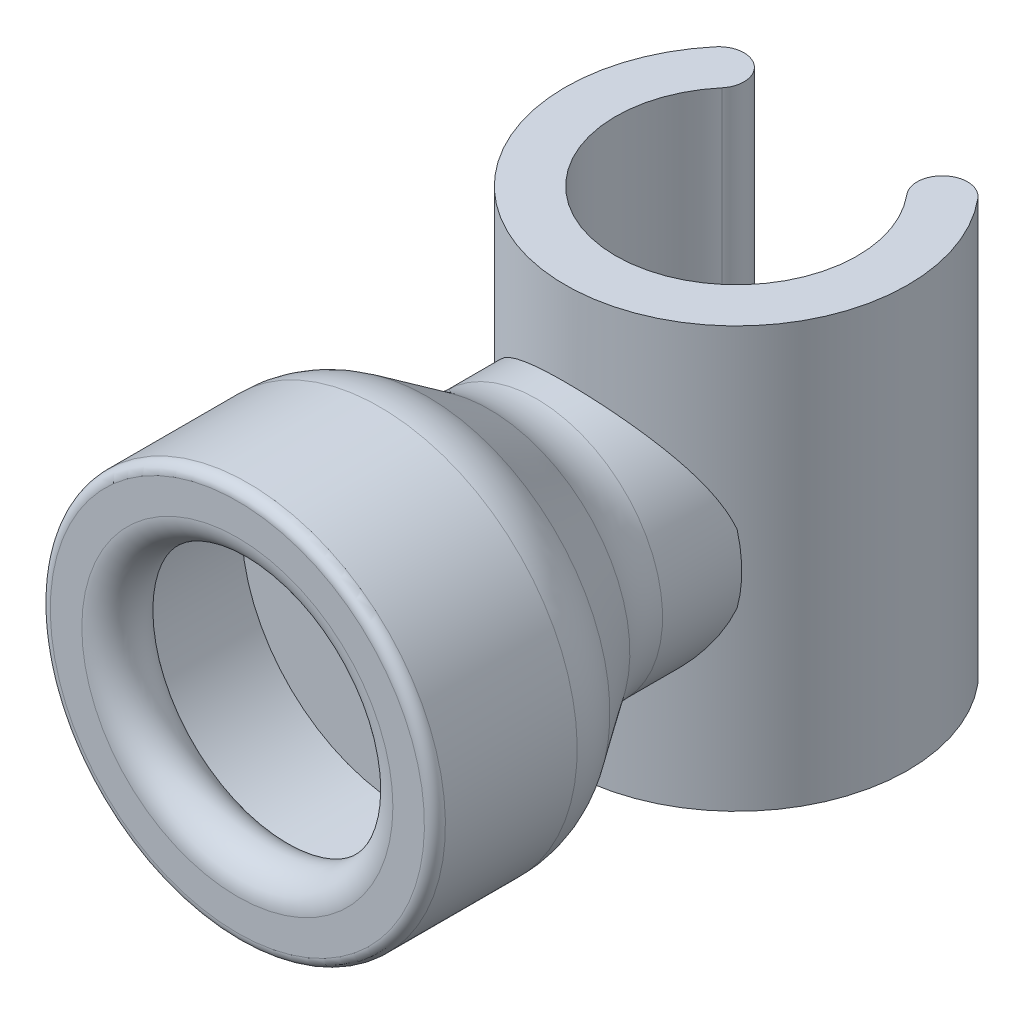
ISO-10303-21;
HEADER;
FILE_DESCRIPTION(('STEP AP214'),'2;1');
FILE_NAME('part.step','',(''),(''),'','','');
FILE_SCHEMA(('AUTOMOTIVE_DESIGN { 1 0 10303 214 1 1 1 1 }'));
ENDSEC;
DATA;
#1=APPLICATION_CONTEXT('core data for automotive mechanical design processes');
#2=APPLICATION_PROTOCOL_DEFINITION('international standard','automotive_design',2000,#1);
#3=PRODUCT_CONTEXT('',#1,'mechanical');
#4=PRODUCT('Part','Part','',(#3));
#5=PRODUCT_RELATED_PRODUCT_CATEGORY('part','',(#4));
#6=PRODUCT_DEFINITION_FORMATION('','',#4);
#7=PRODUCT_DEFINITION_CONTEXT('part definition',#1,'design');
#8=PRODUCT_DEFINITION('design','',#6,#7);
#9=PRODUCT_DEFINITION_SHAPE('','',#8);
#10=(LENGTH_UNIT() NAMED_UNIT(*) SI_UNIT(.MILLI.,.METRE.));
#11=(NAMED_UNIT(*) PLANE_ANGLE_UNIT() SI_UNIT($,.RADIAN.));
#12=(NAMED_UNIT(*) SI_UNIT($,.STERADIAN.) SOLID_ANGLE_UNIT());
#13=UNCERTAINTY_MEASURE_WITH_UNIT(LENGTH_MEASURE(1.E-05),#10,'distance_accuracy_value','');
#14=(GEOMETRIC_REPRESENTATION_CONTEXT(3) GLOBAL_UNCERTAINTY_ASSIGNED_CONTEXT((#13)) GLOBAL_UNIT_ASSIGNED_CONTEXT((#10,
#11,#12)) REPRESENTATION_CONTEXT('',''));
#15=CARTESIAN_POINT('',(0.,0.,0.));
#16=DIRECTION('',(0.,0.,1.));
#17=DIRECTION('',(1.,0.,0.));
#18=AXIS2_PLACEMENT_3D('',#15,#16,#17);
#19=CARTESIAN_POINT('',(0.,-5.,0.));
#20=DIRECTION('',(0.,-1.,0.));
#21=DIRECTION('',(1.,0.,0.));
#22=AXIS2_PLACEMENT_3D('',#19,#20,#21);
#23=PLANE('',#22);
#24=CARTESIAN_POINT('',(0.,-5.,0.));
#25=DIRECTION('',(0.,-1.,0.));
#26=DIRECTION('',(1.,0.,0.));
#27=AXIS2_PLACEMENT_3D('',#24,#25,#26);
#28=CIRCLE('',#27,4.075);
#29=CARTESIAN_POINT('',(3.11900642441656,-5.,-2.62248430394696));
#30=VERTEX_POINT('',#29);
#31=CARTESIAN_POINT('',(-3.11900642441657,-5.,-2.62248430394696));
#32=VERTEX_POINT('',#31);
#33=EDGE_CURVE('E223',#30,#32,#28,.T.);
#34=ORIENTED_EDGE('',*,*,#33,.T.);
#35=CARTESIAN_POINT('',(-2.65976621468652,-5.,-2.2363516456971));
#36=DIRECTION('',(0.,-1.,0.));
#37=DIRECTION('',(1.,0.,0.));
#38=AXIS2_PLACEMENT_3D('',#35,#36,#37);
#39=CIRCLE('',#38,0.6);
#40=CARTESIAN_POINT('',(-2.20013954881513,-5.,-2.62202421150903));
#41=VERTEX_POINT('',#40);
#42=EDGE_CURVE('E217',#32,#41,#39,.T.);
#43=ORIENTED_EDGE('',*,*,#42,.T.);
#44=CARTESIAN_POINT('',(-2.65976621468652,-5.,-2.2363516456971));
#45=DIRECTION('',(0.,-1.,0.));
#46=DIRECTION('',(1.,0.,0.));
#47=AXIS2_PLACEMENT_3D('',#44,#45,#46);
#48=CIRCLE('',#47,0.6);
#49=CARTESIAN_POINT('',(-2.20052600495647,-5.,-1.85021898744724));
#50=VERTEX_POINT('',#49);
#51=EDGE_CURVE('E63',#41,#50,#48,.T.);
#52=ORIENTED_EDGE('',*,*,#51,.T.);
#53=CARTESIAN_POINT('',(0.,-5.,0.));
#54=DIRECTION('',(0.,-1.,0.));
#55=DIRECTION('',(1.,0.,0.));
#56=AXIS2_PLACEMENT_3D('',#53,#54,#55);
#57=CIRCLE('',#56,2.875);
#58=CARTESIAN_POINT('',(2.20052600495647,-5.,-1.85021898744724));
#59=VERTEX_POINT('',#58);
#60=EDGE_CURVE('E140',#59,#50,#57,.T.);
#61=ORIENTED_EDGE('',*,*,#60,.F.);
#62=CARTESIAN_POINT('',(2.65976621468652,-5.,-2.2363516456971));
#63=DIRECTION('',(0.,-1.,0.));
#64=DIRECTION('',(1.,0.,0.));
#65=AXIS2_PLACEMENT_3D('',#62,#63,#64);
#66=CIRCLE('',#65,0.6);
#67=CARTESIAN_POINT('',(2.20013954881513,-5.,-2.62202421150903));
#68=VERTEX_POINT('',#67);
#69=EDGE_CURVE('E209',#59,#68,#66,.T.);
#70=ORIENTED_EDGE('',*,*,#69,.T.);
#71=CARTESIAN_POINT('',(2.65976621468652,-5.,-2.2363516456971));
#72=DIRECTION('',(0.,-1.,0.));
#73=DIRECTION('',(1.,0.,0.));
#74=AXIS2_PLACEMENT_3D('',#71,#72,#73);
#75=CIRCLE('',#74,0.6);
#76=EDGE_CURVE('E212',#68,#30,#75,.T.);
#77=ORIENTED_EDGE('',*,*,#76,.T.);
#78=EDGE_LOOP('',(#34,#43,#52,#61,#70,#77));
#79=FACE_BOUND('',#78,.T.);
#80=ADVANCED_FACE('F45',(#79),#23,.T.);
#81=CARTESIAN_POINT('',(0.,5.,0.));
#82=DIRECTION('',(0.,-1.,0.));
#83=DIRECTION('',(1.,0.,0.));
#84=AXIS2_PLACEMENT_3D('',#81,#82,#83);
#85=PLANE('',#84);
#86=CARTESIAN_POINT('',(-2.65976621468652,5.,-2.2363516456971));
#87=DIRECTION('',(0.,-1.,0.));
#88=DIRECTION('',(1.,0.,0.));
#89=AXIS2_PLACEMENT_3D('',#86,#87,#88);
#90=CIRCLE('',#89,0.6);
#91=CARTESIAN_POINT('',(-2.20052600495647,5.,-1.85021898744725));
#92=VERTEX_POINT('',#91);
#93=CARTESIAN_POINT('',(-2.20013954881513,5.,-2.62202421150903));
#94=VERTEX_POINT('',#93);
#95=EDGE_CURVE('E178',#92,#94,#90,.F.);
#96=ORIENTED_EDGE('',*,*,#95,.T.);
#97=CARTESIAN_POINT('',(-2.65976621468652,5.,-2.2363516456971));
#98=DIRECTION('',(0.,-1.,0.));
#99=DIRECTION('',(1.,0.,0.));
#100=AXIS2_PLACEMENT_3D('',#97,#98,#99);
#101=CIRCLE('',#100,0.6);
#102=CARTESIAN_POINT('',(-3.11900642441657,5.,-2.62248430394696));
#103=VERTEX_POINT('',#102);
#104=EDGE_CURVE('E182',#94,#103,#101,.F.);
#105=ORIENTED_EDGE('',*,*,#104,.T.);
#106=CARTESIAN_POINT('',(0.,5.,0.));
#107=DIRECTION('',(0.,-1.,0.));
#108=DIRECTION('',(1.,0.,0.));
#109=AXIS2_PLACEMENT_3D('',#106,#107,#108);
#110=CIRCLE('',#109,4.075);
#111=CARTESIAN_POINT('',(3.11900642441656,5.,-2.62248430394697));
#112=VERTEX_POINT('',#111);
#113=EDGE_CURVE('E225',#112,#103,#110,.T.);
#114=ORIENTED_EDGE('',*,*,#113,.F.);
#115=CARTESIAN_POINT('',(2.65976621468652,5.,-2.23635164569711));
#116=DIRECTION('',(0.,-1.,0.));
#117=DIRECTION('',(1.,0.,0.));
#118=AXIS2_PLACEMENT_3D('',#115,#116,#117);
#119=CIRCLE('',#118,0.6);
#120=CARTESIAN_POINT('',(2.20013954881513,5.,-2.62202421150903));
#121=VERTEX_POINT('',#120);
#122=EDGE_CURVE('E187',#112,#121,#119,.F.);
#123=ORIENTED_EDGE('',*,*,#122,.T.);
#124=CARTESIAN_POINT('',(2.65976621468652,5.,-2.23635164569711));
#125=DIRECTION('',(0.,-1.,0.));
#126=DIRECTION('',(1.,0.,0.));
#127=AXIS2_PLACEMENT_3D('',#124,#125,#126);
#128=CIRCLE('',#127,0.6);
#129=CARTESIAN_POINT('',(2.20052600495647,5.,-1.85021898744725));
#130=VERTEX_POINT('',#129);
#131=EDGE_CURVE('E257',#121,#130,#128,.F.);
#132=ORIENTED_EDGE('',*,*,#131,.T.);
#133=CARTESIAN_POINT('',(0.,5.,0.));
#134=DIRECTION('',(0.,-1.,0.));
#135=DIRECTION('',(1.,0.,0.));
#136=AXIS2_PLACEMENT_3D('',#133,#134,#135);
#137=CIRCLE('',#136,2.875);
#138=EDGE_CURVE('E135',#130,#92,#137,.T.);
#139=ORIENTED_EDGE('',*,*,#138,.T.);
#140=EDGE_LOOP('',(#96,#105,#114,#123,#132,#139));
#141=FACE_BOUND('',#140,.T.);
#142=ADVANCED_FACE('F170',(#141),#85,.F.);
#143=CARTESIAN_POINT('',(0.,-5.,0.));
#144=DIRECTION('',(0.,1.,0.));
#145=DIRECTION('',(-1.,0.,0.));
#146=AXIS2_PLACEMENT_3D('',#143,#144,#145);
#147=CYLINDRICAL_SURFACE('',#146,4.075);
#148=CARTESIAN_POINT('',(2.88790581563873,-0.812403840463599,2.875));
#149=CARTESIAN_POINT('',(2.86396987335777,-0.897453284394713,2.89904984617288));
#150=CARTESIAN_POINT('',(2.8365410358721,-0.980582858815973,2.9259981833262));
#151=CARTESIAN_POINT('',(2.77521081091253,-1.1426790618383,2.9842252696767));
#152=CARTESIAN_POINT('',(2.74132052686743,-1.2216525395088,3.01549656526744));
#153=CARTESIAN_POINT('',(2.66755311843785,-1.37528525505905,3.08094386239194));
#154=CARTESIAN_POINT('',(2.62768534592957,-1.44995098416575,3.1151152910095));
#155=CARTESIAN_POINT('',(2.54221793107529,-1.59506134909615,3.18524978771818));
#156=CARTESIAN_POINT('',(2.49661555196243,-1.66550394562205,3.22121370627193));
#157=CARTESIAN_POINT('',(2.35215234253959,-1.8695058096925,3.32977646102683));
#158=CARTESIAN_POINT('',(2.24512126426353,-1.99679729167083,3.40352574297608));
#159=CARTESIAN_POINT('',(2.01026162839675,-2.23306280346649,3.5473171158555));
#160=CARTESIAN_POINT('',(1.88242829260121,-2.34203261314063,3.61735835014989));
#161=CARTESIAN_POINT('',(1.62244812061208,-2.52789559651073,3.74053719482807));
#162=CARTESIAN_POINT('',(1.49238205711021,-2.60701306321136,3.79468919471361));
#163=CARTESIAN_POINT('',(1.21816452406372,-2.74583079814262,3.89136554152056));
#164=CARTESIAN_POINT('',(1.07402526042738,-2.80554770161209,3.93389984515969));
#165=CARTESIAN_POINT('',(0.849133978576695,-2.87841739896584,3.98630590120425));
#166=CARTESIAN_POINT('',(0.772342912189284,-2.89998413772647,4.00192127508929));
#167=CARTESIAN_POINT('',(0.616587043103844,-2.93704195364046,4.02885537442209));
#168=CARTESIAN_POINT('',(0.537623375764297,-2.95253614199359,4.04017629998419));
#169=CARTESIAN_POINT('',(0.378214827153008,-2.9771552833664,4.05820257518367));
#170=CARTESIAN_POINT('',(0.297770523200099,-2.98628266705923,4.06490968623662));
#171=CARTESIAN_POINT('',(0.136180671361998,-2.99800395355235,4.07352912946396));
#172=CARTESIAN_POINT('',(0.0550352227760893,-3.00059876678596,4.07544212978531));
#173=CARTESIAN_POINT('',(-0.166424725485071,-2.99865452277607,4.07400718415628));
#174=CARTESIAN_POINT('',(-0.306732934675275,-2.98753283705214,4.06580511493588));
#175=CARTESIAN_POINT('',(-0.582841730451785,-2.94615546987724,4.03550076286465));
#176=CARTESIAN_POINT('',(-0.718641941200782,-2.91589819726477,4.01339732408859));
#177=CARTESIAN_POINT('',(-0.981296699021089,-2.83824899253106,3.95734353287424));
#178=CARTESIAN_POINT('',(-1.10821751309609,-2.7910049986219,3.92349555063636));
#179=CARTESIAN_POINT('',(-1.35211950668457,-2.68135662622725,3.84626903740088));
#180=CARTESIAN_POINT('',(-1.46910013379195,-2.61895140592957,3.80288997721233));
#181=CARTESIAN_POINT('',(-1.70756308655748,-2.47115220306957,3.70254811320194));
#182=CARTESIAN_POINT('',(-1.8273544699331,-2.38375748511809,3.64453242110091));
#183=CARTESIAN_POINT('',(-2.05157956416729,-2.19378235083265,3.52319879903805));
#184=CARTESIAN_POINT('',(-2.15598082321218,-2.09117073608246,3.45987009474344));
#185=CARTESIAN_POINT('',(-2.30973124710229,-1.91643096155526,3.3579059581445));
#186=CARTESIAN_POINT('',(-2.36432373066228,-1.84865961741318,3.31959248315098));
#187=CARTESIAN_POINT('',(-2.46757347071481,-1.70841353961342,3.24358277328851));
#188=CARTESIAN_POINT('',(-2.51622850859452,-1.63593706321784,3.20588677367565));
#189=CARTESIAN_POINT('',(-2.65265498041123,-1.41204032010555,3.09557520389261));
#190=CARTESIAN_POINT('',(-2.73143027027953,-1.25353890980507,3.02535910804588));
#191=CARTESIAN_POINT('',(-2.81358767936852,-1.04211498087328,2.94786908207971));
#192=CARTESIAN_POINT('',(-2.82989564809637,-0.997002922802062,2.93219709791875));
#193=CARTESIAN_POINT('',(-2.86045906191798,-0.905590905107362,2.90238628679099));
#194=CARTESIAN_POINT('',(-2.8747143759611,-0.85929086986026,2.88824755772824));
#195=CARTESIAN_POINT('',(-2.88790581563873,-0.812403840463599,2.875));
#196=B_SPLINE_CURVE_WITH_KNOTS('',3,(#148,#149,#150,#151,#152,#153,#154,#155,#156,#157,#158,
#159,#160,#161,#162,#163,#164,#165,#166,#167,#168,#169,#170,#171,#172,#173,#174,#175,#176,#177,
#178,#179,#180,#181,#182,#183,#184,#185,#186,#187,#188,#189,#190,#191,#192,#193,#194,#195),
.UNSPECIFIED.,.F.,.F.,(4,2,2,2,2,2,2,2,2,2,2,2,2,2,2,2,2,2,2,2,2,2,2,4),(0.,0.27441510762216,
0.548362839222509,0.821886363208285,1.09554092170355,1.63907956269224,2.18274322926595,
2.66561366767767,3.14806896364641,3.3915877967518,3.63498170223898,3.87828263560953,
4.12154965866139,4.54222622834102,4.96293778270041,5.38007072589025,5.7972268352725,
6.2732018086239,6.75016649740683,7.03512834484124,7.32019634846556,7.8876538296769,
8.03899172374996,8.19033927562882),.UNSPECIFIED.);
#197=CARTESIAN_POINT('',(2.88790581563873,-0.812403840463599,2.875));
#198=VERTEX_POINT('',#197);
#199=CARTESIAN_POINT('',(-2.88790581563873,-0.812403840463599,2.875));
#200=VERTEX_POINT('',#199);
#201=EDGE_CURVE('E127',#198,#200,#196,.T.);
#202=ORIENTED_EDGE('',*,*,#201,.T.);
#203=DIRECTION('',(0.,1.,0.));
#204=VECTOR('',#203,1.);
#205=CARTESIAN_POINT('',(-2.88790581563873,-5.,2.875));
#206=LINE('',#205,#204);
#207=CARTESIAN_POINT('',(-2.88790581563873,0.8124038404636,2.875));
#208=VERTEX_POINT('',#207);
#209=EDGE_CURVE('E120',#200,#208,#206,.T.);
#210=ORIENTED_EDGE('',*,*,#209,.T.);
#211=CARTESIAN_POINT('',(-2.88790581563873,0.8124038404636,2.875));
#212=CARTESIAN_POINT('',(-2.86396987335777,0.897453284394714,2.89904984617288));
#213=CARTESIAN_POINT('',(-2.8365410358721,0.980582858815974,2.9259981833262));
#214=CARTESIAN_POINT('',(-2.77521081091253,1.14267906183831,2.9842252696767));
#215=CARTESIAN_POINT('',(-2.74132052686743,1.2216525395088,3.01549656526744));
#216=CARTESIAN_POINT('',(-2.66755311843785,1.37528525505905,3.08094386239194));
#217=CARTESIAN_POINT('',(-2.62768534592957,1.44995098416575,3.1151152910095));
#218=CARTESIAN_POINT('',(-2.54221793107529,1.59506134909615,3.18524978771818));
#219=CARTESIAN_POINT('',(-2.49661555196243,1.66550394562205,3.22121370627193));
#220=CARTESIAN_POINT('',(-2.35215234253959,1.8695058096925,3.32977646102683));
#221=CARTESIAN_POINT('',(-2.24512126426353,1.99679729167083,3.40352574297608));
#222=CARTESIAN_POINT('',(-2.01026162839675,2.23306280346649,3.5473171158555));
#223=CARTESIAN_POINT('',(-1.88242829260121,2.34203261314063,3.61735835014989));
#224=CARTESIAN_POINT('',(-1.62244812061208,2.52789559651073,3.74053719482807));
#225=CARTESIAN_POINT('',(-1.49238205711021,2.60701306321136,3.79468919471361));
#226=CARTESIAN_POINT('',(-1.21816452406372,2.74583079814262,3.89136554152056));
#227=CARTESIAN_POINT('',(-1.07402526042738,2.80554770161209,3.93389984515969));
#228=CARTESIAN_POINT('',(-0.849133978576695,2.87841739896584,3.98630590120425));
#229=CARTESIAN_POINT('',(-0.772342912189283,2.89998413772647,4.00192127508929));
#230=CARTESIAN_POINT('',(-0.616587043103844,2.93704195364046,4.02885537442209));
#231=CARTESIAN_POINT('',(-0.537623375764296,2.95253614199359,4.04017629998419));
#232=CARTESIAN_POINT('',(-0.378214827153008,2.9771552833664,4.05820257518367));
#233=CARTESIAN_POINT('',(-0.297770523200098,2.98628266705923,4.06490968623662));
#234=CARTESIAN_POINT('',(-0.136180671361998,2.99800395355235,4.07352912946396));
#235=CARTESIAN_POINT('',(-0.0550352227760893,3.00059876678596,4.07544212978531));
#236=CARTESIAN_POINT('',(0.166424725485071,2.99865452277607,4.07400718415628));
#237=CARTESIAN_POINT('',(0.306732934675275,2.98753283705214,4.06580511493588));
#238=CARTESIAN_POINT('',(0.582841730451785,2.94615546987724,4.03550076286465));
#239=CARTESIAN_POINT('',(0.718641941200782,2.91589819726477,4.01339732408859));
#240=CARTESIAN_POINT('',(0.981296699021089,2.83824899253106,3.95734353287424));
#241=CARTESIAN_POINT('',(1.10821751309609,2.7910049986219,3.92349555063636));
#242=CARTESIAN_POINT('',(1.35211950668457,2.68135662622725,3.84626903740088));
#243=CARTESIAN_POINT('',(1.46910013379195,2.61895140592957,3.80288997721233));
#244=CARTESIAN_POINT('',(1.70756308655748,2.47115220306957,3.70254811320194));
#245=CARTESIAN_POINT('',(1.8273544699331,2.38375748511809,3.64453242110091));
#246=CARTESIAN_POINT('',(2.05157956416729,2.19378235083266,3.52319879903805));
#247=CARTESIAN_POINT('',(2.15598082321219,2.09117073608246,3.45987009474344));
#248=CARTESIAN_POINT('',(2.30973124710229,1.91643096155526,3.3579059581445));
#249=CARTESIAN_POINT('',(2.36432373066228,1.84865961741318,3.31959248315098));
#250=CARTESIAN_POINT('',(2.46757347071481,1.70841353961342,3.24358277328851));
#251=CARTESIAN_POINT('',(2.51622850859452,1.63593706321784,3.20588677367565));
#252=CARTESIAN_POINT('',(2.65265498041123,1.41204032010555,3.09557520389261));
#253=CARTESIAN_POINT('',(2.73143027027953,1.25353890980507,3.02535910804588));
#254=CARTESIAN_POINT('',(2.81358767936852,1.04211498087328,2.94786908207971));
#255=CARTESIAN_POINT('',(2.82989564809637,0.997002922802063,2.93219709791875));
#256=CARTESIAN_POINT('',(2.86045906191798,0.905590905107363,2.90238628679099));
#257=CARTESIAN_POINT('',(2.8747143759611,0.85929086986026,2.88824755772824));
#258=CARTESIAN_POINT('',(2.88790581563873,0.812403840463599,2.875));
#259=B_SPLINE_CURVE_WITH_KNOTS('',3,(#211,#212,#213,#214,#215,#216,#217,#218,#219,#220,#221,
#222,#223,#224,#225,#226,#227,#228,#229,#230,#231,#232,#233,#234,#235,#236,#237,#238,#239,#240,
#241,#242,#243,#244,#245,#246,#247,#248,#249,#250,#251,#252,#253,#254,#255,#256,#257,#258),
.UNSPECIFIED.,.F.,.F.,(4,2,2,2,2,2,2,2,2,2,2,2,2,2,2,2,2,2,2,2,2,2,2,4),(0.,0.27441510762216,
0.54836283922251,0.821886363208286,1.09554092170355,1.63907956269224,2.18274322926595,
2.66561366767767,3.14806896364641,3.3915877967518,3.63498170223898,3.87828263560953,
4.12154965866139,4.54222622834102,4.96293778270041,5.38007072589025,5.7972268352725,
6.2732018086239,6.75016649740683,7.03512834484124,7.32019634846556,7.8876538296769,
8.03899172374996,8.19033927562882),.UNSPECIFIED.);
#260=CARTESIAN_POINT('',(2.88790581563873,0.8124038404636,2.875));
#261=VERTEX_POINT('',#260);
#262=EDGE_CURVE('E125',#208,#261,#259,.T.);
#263=ORIENTED_EDGE('',*,*,#262,.T.);
#264=DIRECTION('',(0.,1.,0.));
#265=VECTOR('',#264,1.);
#266=CARTESIAN_POINT('',(2.88790581563873,-5.,2.875));
#267=LINE('',#266,#265);
#268=EDGE_CURVE('E111',#261,#198,#267,.F.);
#269=ORIENTED_EDGE('',*,*,#268,.T.);
#270=EDGE_LOOP('',(#202,#210,#263,#269));
#271=FACE_BOUND('',#270,.T.);
#272=ORIENTED_EDGE('',*,*,#113,.T.);
#273=DIRECTION('',(0.,1.,0.));
#274=VECTOR('',#273,1.);
#275=CARTESIAN_POINT('',(-3.11900642441657,-5.,-2.62248430394696));
#276=LINE('',#275,#274);
#277=EDGE_CURVE('E198',#103,#32,#276,.F.);
#278=ORIENTED_EDGE('',*,*,#277,.T.);
#279=ORIENTED_EDGE('',*,*,#33,.F.);
#280=DIRECTION('',(0.,1.,0.));
#281=VECTOR('',#280,1.);
#282=CARTESIAN_POINT('',(3.11900642441656,-5.,-2.62248430394696));
#283=LINE('',#282,#281);
#284=EDGE_CURVE('E200',#30,#112,#283,.T.);
#285=ORIENTED_EDGE('',*,*,#284,.T.);
#286=EDGE_LOOP('',(#272,#278,#279,#285));
#287=FACE_BOUND('',#286,.T.);
#288=ADVANCED_FACE('F132',(#271,#287),#147,.T.);
#289=CARTESIAN_POINT('',(0.,-5.,0.));
#290=DIRECTION('',(0.,1.,0.));
#291=DIRECTION('',(-1.,0.,0.));
#292=AXIS2_PLACEMENT_3D('',#289,#290,#291);
#293=CYLINDRICAL_SURFACE('',#292,2.875);
#294=ORIENTED_EDGE('',*,*,#60,.T.);
#295=DIRECTION('',(0.,1.,0.));
#296=VECTOR('',#295,1.);
#297=CARTESIAN_POINT('',(-2.20052600495647,-5.,-1.85021898744724));
#298=LINE('',#297,#296);
#299=EDGE_CURVE('E11',#50,#92,#298,.T.);
#300=ORIENTED_EDGE('',*,*,#299,.T.);
#301=ORIENTED_EDGE('',*,*,#138,.F.);
#302=DIRECTION('',(0.,1.,0.));
#303=VECTOR('',#302,1.);
#304=CARTESIAN_POINT('',(2.20052600495647,-5.,-1.85021898744724));
#305=LINE('',#304,#303);
#306=EDGE_CURVE('E55',#130,#59,#305,.F.);
#307=ORIENTED_EDGE('',*,*,#306,.T.);
#308=EDGE_LOOP('',(#294,#300,#301,#307));
#309=FACE_BOUND('',#308,.T.);
#310=ADVANCED_FACE('F163',(#309),#293,.F.);
#311=CARTESIAN_POINT('',(0.,0.,7.875));
#312=DIRECTION('',(0.,0.,-1.));
#313=DIRECTION('',(0.,1.,0.));
#314=AXIS2_PLACEMENT_3D('',#311,#312,#313);
#315=CYLINDRICAL_SURFACE('',#314,3.);
#316=CARTESIAN_POINT('',(0.,0.,4.75941965698095));
#317=DIRECTION('',(0.,0.,1.));
#318=DIRECTION('',(0.,-1.,0.));
#319=AXIS2_PLACEMENT_3D('',#316,#317,#318);
#320=CIRCLE('',#319,3.);
#321=CARTESIAN_POINT('',(0.,-3.,4.75941965698095));
#322=VERTEX_POINT('',#321);
#323=EDGE_CURVE('E245',#322,#322,#320,.F.);
#324=ORIENTED_EDGE('',*,*,#323,.T.);
#325=EDGE_LOOP('',(#324));
#326=FACE_BOUND('',#325,.T.);
#327=ORIENTED_EDGE('',*,*,#262,.F.);
#328=CARTESIAN_POINT('',(0.,0.,2.875));
#329=DIRECTION('',(0.,0.,-1.));
#330=DIRECTION('',(0.,1.,0.));
#331=AXIS2_PLACEMENT_3D('',#328,#329,#330);
#332=CIRCLE('',#331,3.);
#333=EDGE_CURVE('E129',#200,#208,#332,.T.);
#334=ORIENTED_EDGE('',*,*,#333,.F.);
#335=ORIENTED_EDGE('',*,*,#201,.F.);
#336=EDGE_CURVE('E114',#261,#198,#332,.T.);
#337=ORIENTED_EDGE('',*,*,#336,.F.);
#338=EDGE_LOOP('',(#327,#334,#335,#337));
#339=FACE_BOUND('',#338,.T.);
#340=ADVANCED_FACE('F123',(#326,#339),#315,.T.);
#341=CARTESIAN_POINT('',(0.,0.,2.875));
#342=DIRECTION('',(0.,0.,-1.));
#343=DIRECTION('',(0.,1.,0.));
#344=AXIS2_PLACEMENT_3D('',#341,#342,#343);
#345=PLANE('',#344);
#346=ORIENTED_EDGE('',*,*,#209,.F.);
#347=ORIENTED_EDGE('',*,*,#333,.T.);
#348=EDGE_LOOP('',(#346,#347));
#349=FACE_BOUND('',#348,.T.);
#350=ADVANCED_FACE('F162',(#349),#345,.T.);
#351=ORIENTED_EDGE('',*,*,#268,.F.);
#352=ORIENTED_EDGE('',*,*,#336,.T.);
#353=EDGE_LOOP('',(#351,#352));
#354=FACE_BOUND('',#353,.T.);
#355=ADVANCED_FACE('F113',(#354),#345,.T.);
#356=CARTESIAN_POINT('',(0.,0.,5.375));
#357=DIRECTION('',(0.,0.,1.));
#358=DIRECTION('',(0.,-1.,0.));
#359=AXIS2_PLACEMENT_3D('',#356,#357,#358);
#360=CONICAL_SURFACE('',#359,3.,0.597176658092678);
#361=CARTESIAN_POINT('',(0.,0.,7.3659603002045));
#362=DIRECTION('',(0.,0.,-1.));
#363=DIRECTION('',(0.,1.,0.));
#364=AXIS2_PLACEMENT_3D('',#361,#362,#363);
#365=CIRCLE('',#364,4.35385300413906);
#366=CARTESIAN_POINT('',(0.,4.35385300413906,7.36596030020449));
#367=VERTEX_POINT('',#366);
#368=EDGE_CURVE('E237',#367,#367,#365,.T.);
#369=ORIENTED_EDGE('',*,*,#368,.T.);
#370=EDGE_LOOP('',(#369));
#371=FACE_BOUND('',#370,.T.);
#372=CARTESIAN_POINT('',(0.,0.,5.8840396997955));
#373=DIRECTION('',(0.,0.,1.));
#374=DIRECTION('',(0.,-1.,0.));
#375=AXIS2_PLACEMENT_3D('',#372,#373,#374);
#376=CIRCLE('',#375,3.34614699586094);
#377=CARTESIAN_POINT('',(0.,-3.34614699586094,5.8840396997955));
#378=VERTEX_POINT('',#377);
#379=EDGE_CURVE('E233',#378,#378,#376,.T.);
#380=ORIENTED_EDGE('',*,*,#379,.T.);
#381=EDGE_LOOP('',(#380));
#382=FACE_BOUND('',#381,.T.);
#383=ADVANCED_FACE('F303',(#371,#382),#360,.T.);
#384=CARTESIAN_POINT('',(0.,0.,0.));
#385=DIRECTION('',(0.,0.,-1.));
#386=DIRECTION('',(0.,1.,0.));
#387=AXIS2_PLACEMENT_3D('',#384,#385,#386);
#388=CYLINDRICAL_SURFACE('',#387,4.7);
#389=CARTESIAN_POINT('',(0.,0.,11.625));
#390=DIRECTION('',(0.,0.,1.));
#391=DIRECTION('',(0.,-1.,0.));
#392=AXIS2_PLACEMENT_3D('',#389,#390,#391);
#393=CIRCLE('',#392,4.7);
#394=CARTESIAN_POINT('',(0.,-4.7,11.625));
#395=VERTEX_POINT('',#394);
#396=EDGE_CURVE('E249',#395,#395,#393,.F.);
#397=ORIENTED_EDGE('',*,*,#396,.T.);
#398=EDGE_LOOP('',(#397));
#399=FACE_BOUND('',#398,.T.);
#400=CARTESIAN_POINT('',(0.,0.,8.49058034301905));
#401=DIRECTION('',(0.,0.,1.));
#402=DIRECTION('',(0.,-1.,0.));
#403=AXIS2_PLACEMENT_3D('',#400,#401,#402);
#404=CIRCLE('',#403,4.7);
#405=CARTESIAN_POINT('',(0.,-4.7,8.49058034301905));
#406=VERTEX_POINT('',#405);
#407=EDGE_CURVE('E241',#406,#406,#404,.T.);
#408=ORIENTED_EDGE('',*,*,#407,.T.);
#409=EDGE_LOOP('',(#408));
#410=FACE_BOUND('',#409,.T.);
#411=ADVANCED_FACE('F337',(#399,#410),#388,.T.);
#412=CARTESIAN_POINT('',(4.7,0.,11.875));
#413=DIRECTION('',(0.,0.,1.));
#414=DIRECTION('',(0.,-1.,0.));
#415=AXIS2_PLACEMENT_3D('',#412,#413,#414);
#416=PLANE('',#415);
#417=CARTESIAN_POINT('',(0.,0.,11.875));
#418=DIRECTION('',(0.,0.,1.));
#419=DIRECTION('',(0.,-1.,0.));
#420=AXIS2_PLACEMENT_3D('',#417,#418,#419);
#421=CIRCLE('',#420,4.45);
#422=CARTESIAN_POINT('',(0.,-4.45,11.875));
#423=VERTEX_POINT('',#422);
#424=EDGE_CURVE('E253',#423,#423,#421,.T.);
#425=ORIENTED_EDGE('',*,*,#424,.T.);
#426=EDGE_LOOP('',(#425));
#427=FACE_BOUND('',#426,.T.);
#428=CARTESIAN_POINT('',(0.,0.,11.875));
#429=DIRECTION('',(0.,0.,-1.));
#430=DIRECTION('',(0.,1.,0.));
#431=AXIS2_PLACEMENT_3D('',#428,#429,#430);
#432=CIRCLE('',#431,3.7);
#433=CARTESIAN_POINT('',(0.,3.7,11.875));
#434=VERTEX_POINT('',#433);
#435=EDGE_CURVE('E280',#434,#434,#432,.T.);
#436=ORIENTED_EDGE('',*,*,#435,.T.);
#437=EDGE_LOOP('',(#436));
#438=FACE_BOUND('',#437,.T.);
#439=ADVANCED_FACE('F332',(#427,#438),#416,.T.);
#440=CARTESIAN_POINT('',(0.,0.,11.175));
#441=DIRECTION('',(0.,0.,-1.));
#442=DIRECTION('',(0.,1.,0.));
#443=AXIS2_PLACEMENT_3D('',#440,#441,#442);
#444=TOROIDAL_SURFACE('',#443,3.7,0.699999999999999);
#445=CARTESIAN_POINT('',(0.,0.,10.475));
#446=DIRECTION('',(0.,0.,-1.));
#447=DIRECTION('',(0.,1.,0.));
#448=AXIS2_PLACEMENT_3D('',#445,#446,#447);
#449=CIRCLE('',#448,3.7);
#450=CARTESIAN_POINT('',(0.,3.7,10.475));
#451=VERTEX_POINT('',#450);
#452=EDGE_CURVE('E276',#451,#451,#449,.T.);
#453=ORIENTED_EDGE('',*,*,#452,.T.);
#454=EDGE_LOOP('',(#453));
#455=FACE_BOUND('',#454,.T.);
#456=ORIENTED_EDGE('',*,*,#435,.F.);
#457=EDGE_LOOP('',(#456));
#458=FACE_BOUND('',#457,.T.);
#459=ADVANCED_FACE('F326',(#455,#458),#444,.T.);
#460=CARTESIAN_POINT('',(3.7,0.,10.475));
#461=DIRECTION('',(0.,0.,-1.));
#462=DIRECTION('',(0.,1.,0.));
#463=AXIS2_PLACEMENT_3D('',#460,#461,#462);
#464=PLANE('',#463);
#465=CARTESIAN_POINT('',(0.,0.,10.475));
#466=DIRECTION('',(0.,0.,-1.));
#467=DIRECTION('',(0.,1.,0.));
#468=AXIS2_PLACEMENT_3D('',#465,#466,#467);
#469=CIRCLE('',#468,3.9);
#470=CARTESIAN_POINT('',(0.,3.9,10.475));
#471=VERTEX_POINT('',#470);
#472=EDGE_CURVE('E272',#471,#471,#469,.T.);
#473=ORIENTED_EDGE('',*,*,#472,.T.);
#474=EDGE_LOOP('',(#473));
#475=FACE_BOUND('',#474,.T.);
#476=ORIENTED_EDGE('',*,*,#452,.F.);
#477=EDGE_LOOP('',(#476));
#478=FACE_BOUND('',#477,.T.);
#479=ADVANCED_FACE('F320',(#475,#478),#464,.T.);
#480=CARTESIAN_POINT('',(0.,0.,0.));
#481=DIRECTION('',(0.,0.,-1.));
#482=DIRECTION('',(0.,1.,0.));
#483=AXIS2_PLACEMENT_3D('',#480,#481,#482);
#484=CYLINDRICAL_SURFACE('',#483,3.9);
#485=CARTESIAN_POINT('',(0.,0.,7.875));
#486=DIRECTION('',(0.,0.,-1.));
#487=DIRECTION('',(0.,1.,0.));
#488=AXIS2_PLACEMENT_3D('',#485,#486,#487);
#489=CIRCLE('',#488,3.9);
#490=CARTESIAN_POINT('',(0.,3.9,7.875));
#491=VERTEX_POINT('',#490);
#492=EDGE_CURVE('E194',#491,#491,#489,.T.);
#493=ORIENTED_EDGE('',*,*,#492,.T.);
#494=EDGE_LOOP('',(#493));
#495=FACE_BOUND('',#494,.T.);
#496=ORIENTED_EDGE('',*,*,#472,.F.);
#497=EDGE_LOOP('',(#496));
#498=FACE_BOUND('',#497,.T.);
#499=ADVANCED_FACE('F317',(#495,#498),#484,.F.);
#500=CARTESIAN_POINT('',(0.,0.950000000000001,4.075));
#501=CARTESIAN_POINT('',(0.0525998624309189,0.949998335742757,4.07499905262148));
#502=CARTESIAN_POINT('',(0.105219126932674,0.945616724803785,4.07397130569958));
#503=CARTESIAN_POINT('',(0.208957021002395,0.928227813041077,4.06997082053608));
#504=CARTESIAN_POINT('',(0.260074654670637,0.91521491695512,4.06699682064558));
#505=CARTESIAN_POINT('',(0.359295595901938,0.880997903557039,4.05943416059737));
#506=CARTESIAN_POINT('',(0.40740219478159,0.859802918328539,4.05484730106991));
#507=CARTESIAN_POINT('',(0.499375881787197,0.809853788860266,4.04455104201564));
#508=CARTESIAN_POINT('',(0.543242965138958,0.781099636108117,4.03884164122474));
#509=CARTESIAN_POINT('',(0.626286570945984,0.716298566517449,4.02680781778389));
#510=CARTESIAN_POINT('',(0.665375469549095,0.680140923813907,4.02047492141353));
#511=CARTESIAN_POINT('',(0.736992520533975,0.601796680153179,4.00796602449657));
#512=CARTESIAN_POINT('',(0.769520022004527,0.559609481753694,4.00179003956916));
#513=CARTESIAN_POINT('',(0.827488846096512,0.46974134004243,3.9902098911001));
#514=CARTESIAN_POINT('',(0.852834781297754,0.421997348636823,3.9848165430208));
#515=CARTESIAN_POINT('',(0.895108452464439,0.322780773912883,3.97553485972995));
#516=CARTESIAN_POINT('',(0.912037343679232,0.271308703389506,3.97164631799819));
#517=CARTESIAN_POINT('',(0.936702616561624,0.167053547716667,3.96590119702645));
#518=CARTESIAN_POINT('',(0.944595235064205,0.114309368805398,3.96401012753525));
#519=CARTESIAN_POINT('',(0.9514501132755,0.00821425041043636,3.96237063858447));
#520=CARTESIAN_POINT('',(0.950413626603418,-0.045136602847683,3.9626219183455));
#521=CARTESIAN_POINT('',(0.939564965824083,-0.149753403925175,3.96520760858529));
#522=CARTESIAN_POINT('',(0.929936335098498,-0.20103962729872,3.96749844813137));
#523=CARTESIAN_POINT('',(0.90246838609377,-0.301248076929689,3.9738360079225));
#524=CARTESIAN_POINT('',(0.884628551444128,-0.35017015430139,3.97788283859405));
#525=CARTESIAN_POINT('',(0.841081517604806,-0.444766936510303,3.9873180220354));
#526=CARTESIAN_POINT('',(0.815305518232316,-0.490408758901067,3.99271802637739));
#527=CARTESIAN_POINT('',(0.756666094579172,-0.57678627893594,4.00424422493022));
#528=CARTESIAN_POINT('',(0.723801580955594,-0.617521221003282,4.01037053069178));
#529=CARTESIAN_POINT('',(0.65095570380109,-0.693983273927885,4.02284445881728));
#530=CARTESIAN_POINT('',(0.610818778593353,-0.729562061912738,4.02919381267566));
#531=CARTESIAN_POINT('',(0.525074057783522,-0.793509658088922,4.04126140774059));
#532=CARTESIAN_POINT('',(0.479466135174773,-0.821878298852348,4.04697963428989));
#533=CARTESIAN_POINT('',(0.38387945737366,-0.870644789582753,4.0571634042079));
#534=CARTESIAN_POINT('',(0.333889348970586,-0.891021139120116,4.06162555959146));
#535=CARTESIAN_POINT('',(0.231066952301886,-0.923041808527246,4.06876953408636));
#536=CARTESIAN_POINT('',(0.178235136551788,-0.934687575326283,4.07145164819748));
#537=CARTESIAN_POINT('',(0.0724994326893882,-0.948695982210822,4.07469060491146));
#538=CARTESIAN_POINT('',(0.0196237304839753,-0.95126094567904,4.0752937592484));
#539=CARTESIAN_POINT('',(-0.0858008567042663,-0.947586227747198,4.07443756074263));
#540=CARTESIAN_POINT('',(-0.138349766729838,-0.941347229575775,4.0729783679477));
#541=CARTESIAN_POINT('',(-0.240944176324848,-0.920409072983727,4.06819086455392));
#542=CARTESIAN_POINT('',(-0.291012934738702,-0.905817931842152,4.06488643132828));
#543=CARTESIAN_POINT('',(-0.387991223972339,-0.868711119084567,4.0567792447074));
#544=CARTESIAN_POINT('',(-0.434900461338534,-0.8461947125826,4.05197635236926));
#545=CARTESIAN_POINT('',(-0.525050750071185,-0.793468164847302,4.04129210067459));
#546=CARTESIAN_POINT('',(-0.568221793729269,-0.763141623131191,4.03539483942652));
#547=CARTESIAN_POINT('',(-0.648934402755282,-0.695806900152632,4.02320496418701));
#548=CARTESIAN_POINT('',(-0.686475128805936,-0.658797724511745,4.01691229144917));
#549=CARTESIAN_POINT('',(-0.755676661195492,-0.578214572466825,4.004477791888));
#550=CARTESIAN_POINT('',(-0.787196493276523,-0.534518425332435,3.99834196032453));
#551=CARTESIAN_POINT('',(-0.842452841784651,-0.442335220194861,3.98706617241653));
#552=CARTESIAN_POINT('',(-0.866189705359668,-0.393848375999279,3.9819261716586));
#553=CARTESIAN_POINT('',(-0.905036744330567,-0.293724872543088,3.97327695874396));
#554=CARTESIAN_POINT('',(-0.92019729456006,-0.242108620503522,3.96975824673639));
#555=CARTESIAN_POINT('',(-0.941603317805263,-0.136967203353161,3.96473597092385));
#556=CARTESIAN_POINT('',(-0.94785044374726,-0.083442394057195,3.9632320334975));
#557=CARTESIAN_POINT('',(-0.951174643453273,0.0225697995046739,3.96243536747719));
#558=CARTESIAN_POINT('',(-0.948475980538417,0.0750498660427436,3.96308855991381));
#559=CARTESIAN_POINT('',(-0.934491863015633,0.178784923036098,3.9664090350613));
#560=CARTESIAN_POINT('',(-0.923206539535282,0.230039932187004,3.96907628701529));
#561=CARTESIAN_POINT('',(-0.892484286843123,0.329662552940623,3.9760962630525));
#562=CARTESIAN_POINT('',(-0.873084204243071,0.378042101059942,3.98044136178494));
#563=CARTESIAN_POINT('',(-0.826713351150252,0.470891506990098,3.99032950889686));
#564=CARTESIAN_POINT('',(-0.799741671666754,0.515360894533265,3.99587270109233));
#565=CARTESIAN_POINT('',(-0.738267626793528,0.600223613903484,4.00769074114804));
#566=CARTESIAN_POINT('',(-0.703607279372203,0.64050060065987,4.01397941223229));
#567=CARTESIAN_POINT('',(-0.628054568286043,0.714739866439728,4.02649176315098));
#568=CARTESIAN_POINT('',(-0.587160752087374,0.748700669549389,4.03271542747532));
#569=CARTESIAN_POINT('',(-0.499552920844796,0.809841611820338,4.04450895771068));
#570=CARTESIAN_POINT('',(-0.452759967149648,0.836910975565793,4.05006746274922));
#571=CARTESIAN_POINT('',(-0.355165510342192,0.882756558826558,4.05978805000212));
#572=CARTESIAN_POINT('',(-0.304367191941307,0.901539290303414,4.06395122809872));
#573=CARTESIAN_POINT('',(-0.211314425331693,0.92717686170763,4.06972522072953));
#574=CARTESIAN_POINT('',(-0.169538432511249,0.93571827113987,4.07169042898664));
#575=CARTESIAN_POINT('',(-0.0851791704340699,0.947130353358675,4.07432816556661));
#576=CARTESIAN_POINT('',(-0.0425959470964269,0.95000134773382,4.07500076719755));
#577=CARTESIAN_POINT('',(0.,0.950000000000001,4.075));
#578=B_SPLINE_CURVE_WITH_KNOTS('',3,(#500,#501,#502,#503,#504,#505,#506,#507,#508,#509,#510,
#511,#512,#513,#514,#515,#516,#517,#518,#519,#520,#521,#522,#523,#524,#525,#526,#527,#528,#529,
#530,#531,#532,#533,#534,#535,#536,#537,#538,#539,#540,#541,#542,#543,#544,#545,#546,#547,#548,
#549,#550,#551,#552,#553,#554,#555,#556,#557,#558,#559,#560,#561,#562,#563,#564,#565,#566,#567,
#568,#569,#570,#571,#572,#573,#574,#575,#576,#577),.UNSPECIFIED.,.T.,.F.,(4,2,2,2,2,2,2,2,2,2,2,
2,2,2,2,2,2,2,2,2,2,2,2,2,2,2,2,2,2,2,2,2,2,2,2,2,2,2,4),(0.,0.157643590657339,
0.315389474357462,0.47295980349944,0.630530310082085,0.790656662695874,0.950798892543418,
1.11297789534769,1.2751346327411,1.4344432103415,1.59372942186675,1.74969235361312,
1.90566509459859,2.06302999555312,2.22041909715531,2.38169071939355,2.54296608620211,
2.70467237952628,2.86635186715686,3.02440558714638,3.18244704210187,3.33848931167995,
3.49454605440062,3.65307878762231,3.81163513004314,3.97354114123642,4.13543992986635,
4.29637762506836,4.45728547172639,4.6141903037897,4.77109273979492,4.92729033426203,
5.08350668869902,5.24329229860112,5.40311519910698,5.56536460544426,5.72748628171654,
5.85515503595324,5.98281654945149),.UNSPECIFIED.);
#579=CARTESIAN_POINT('',(0.,0.950000000000001,4.075));
#580=VERTEX_POINT('',#579);
#581=EDGE_CURVE('E230',#580,#580,#578,.T.);
#582=ORIENTED_EDGE('',*,*,#581,.F.);
#583=EDGE_LOOP('',(#582));
#584=FACE_BOUND('',#583,.T.);
#585=ADVANCED_FACE('F176',(#584),#147,.T.);
#586=CARTESIAN_POINT('',(0.,0.,7.875));
#587=DIRECTION('',(0.,0.,-1.));
#588=DIRECTION('',(0.,1.,0.));
#589=AXIS2_PLACEMENT_3D('',#586,#587,#588);
#590=CYLINDRICAL_SURFACE('',#589,0.95);
#591=CARTESIAN_POINT('',(0.,0.,7.875));
#592=DIRECTION('',(0.,0.,-1.));
#593=DIRECTION('',(0.,1.,0.));
#594=AXIS2_PLACEMENT_3D('',#591,#592,#593);
#595=CIRCLE('',#594,0.95);
#596=CARTESIAN_POINT('',(0.,0.950000000000001,7.875));
#597=VERTEX_POINT('',#596);
#598=EDGE_CURVE('E284',#597,#597,#595,.T.);
#599=ORIENTED_EDGE('',*,*,#598,.F.);
#600=EDGE_LOOP('',(#599));
#601=FACE_BOUND('',#600,.T.);
#602=ORIENTED_EDGE('',*,*,#581,.T.);
#603=EDGE_LOOP('',(#602));
#604=FACE_BOUND('',#603,.T.);
#605=ADVANCED_FACE('F297',(#601,#604),#590,.F.);
#606=CARTESIAN_POINT('',(0.,0.,7.875));
#607=DIRECTION('',(0.,0.,-1.));
#608=DIRECTION('',(0.,1.,0.));
#609=AXIS2_PLACEMENT_3D('',#606,#607,#608);
#610=PLANE('',#609);
#611=ORIENTED_EDGE('',*,*,#598,.T.);
#612=EDGE_LOOP('',(#611));
#613=FACE_BOUND('',#612,.T.);
#614=ORIENTED_EDGE('',*,*,#492,.F.);
#615=EDGE_LOOP('',(#614));
#616=FACE_BOUND('',#615,.T.);
#617=ADVANCED_FACE('F301',(#613,#616),#610,.F.);
#618=CARTESIAN_POINT('',(0.,0.,8.49058034301905));
#619=DIRECTION('',(0.,0.,1.));
#620=DIRECTION('',(0.,-1.,0.));
#621=AXIS2_PLACEMENT_3D('',#618,#619,#620);
#622=TOROIDAL_SURFACE('',#621,2.7,2.);
#623=ORIENTED_EDGE('',*,*,#407,.F.);
#624=EDGE_LOOP('',(#623));
#625=FACE_BOUND('',#624,.T.);
#626=ORIENTED_EDGE('',*,*,#368,.F.);
#627=EDGE_LOOP('',(#626));
#628=FACE_BOUND('',#627,.T.);
#629=ADVANCED_FACE('F306',(#625,#628),#622,.T.);
#630=CARTESIAN_POINT('',(0.,0.,4.75941965698095));
#631=DIRECTION('',(0.,0.,1.));
#632=DIRECTION('',(0.,-1.,0.));
#633=AXIS2_PLACEMENT_3D('',#630,#631,#632);
#634=TOROIDAL_SURFACE('',#633,5.,2.);
#635=ORIENTED_EDGE('',*,*,#323,.F.);
#636=EDGE_LOOP('',(#635));
#637=FACE_BOUND('',#636,.T.);
#638=ORIENTED_EDGE('',*,*,#379,.F.);
#639=EDGE_LOOP('',(#638));
#640=FACE_BOUND('',#639,.T.);
#641=ADVANCED_FACE('F311',(#637,#640),#634,.F.);
#642=CARTESIAN_POINT('',(0.,0.,11.625));
#643=DIRECTION('',(0.,0.,1.));
#644=DIRECTION('',(0.,-1.,0.));
#645=AXIS2_PLACEMENT_3D('',#642,#643,#644);
#646=TOROIDAL_SURFACE('',#645,4.45,0.25);
#647=ORIENTED_EDGE('',*,*,#424,.F.);
#648=EDGE_LOOP('',(#647));
#649=FACE_BOUND('',#648,.T.);
#650=ORIENTED_EDGE('',*,*,#396,.F.);
#651=EDGE_LOOP('',(#650));
#652=FACE_BOUND('',#651,.T.);
#653=ADVANCED_FACE('F346',(#649,#652),#646,.T.);
#654=CARTESIAN_POINT('',(-2.65976621468652,-5.,-2.2363516456971));
#655=DIRECTION('',(0.,1.,0.));
#656=DIRECTION('',(-1.,0.,0.));
#657=AXIS2_PLACEMENT_3D('',#654,#655,#656);
#658=CYLINDRICAL_SURFACE('',#657,0.6);
#659=ORIENTED_EDGE('',*,*,#299,.F.);
#660=ORIENTED_EDGE('',*,*,#51,.F.);
#661=DIRECTION('',(0.,-1.,0.));
#662=VECTOR('',#661,1.);
#663=CARTESIAN_POINT('',(-2.20013954881513,-5.,-2.62202421150903));
#664=LINE('',#663,#662);
#665=EDGE_CURVE('E190',#94,#41,#664,.T.);
#666=ORIENTED_EDGE('',*,*,#665,.F.);
#667=ORIENTED_EDGE('',*,*,#95,.F.);
#668=EDGE_LOOP('',(#659,#660,#666,#667));
#669=FACE_BOUND('',#668,.T.);
#670=ADVANCED_FACE('F191',(#669),#658,.T.);
#671=CARTESIAN_POINT('',(-2.65976621468652,-5.,-2.2363516456971));
#672=DIRECTION('',(0.,1.,0.));
#673=DIRECTION('',(-1.,0.,0.));
#674=AXIS2_PLACEMENT_3D('',#671,#672,#673);
#675=CYLINDRICAL_SURFACE('',#674,0.6);
#676=ORIENTED_EDGE('',*,*,#42,.F.);
#677=ORIENTED_EDGE('',*,*,#277,.F.);
#678=ORIENTED_EDGE('',*,*,#104,.F.);
#679=ORIENTED_EDGE('',*,*,#665,.T.);
#680=EDGE_LOOP('',(#676,#677,#678,#679));
#681=FACE_BOUND('',#680,.T.);
#682=ADVANCED_FACE('F196',(#681),#675,.T.);
#683=CARTESIAN_POINT('',(2.65976621468652,-5.,-2.2363516456971));
#684=DIRECTION('',(0.,1.,0.));
#685=DIRECTION('',(-1.,0.,0.));
#686=AXIS2_PLACEMENT_3D('',#683,#684,#685);
#687=CYLINDRICAL_SURFACE('',#686,0.6);
#688=DIRECTION('',(0.,-1.,0.));
#689=VECTOR('',#688,1.);
#690=CARTESIAN_POINT('',(2.20013954881513,5.,-2.62202421150903));
#691=LINE('',#690,#689);
#692=EDGE_CURVE('E49',#68,#121,#691,.F.);
#693=ORIENTED_EDGE('',*,*,#692,.F.);
#694=ORIENTED_EDGE('',*,*,#69,.F.);
#695=ORIENTED_EDGE('',*,*,#306,.F.);
#696=ORIENTED_EDGE('',*,*,#131,.F.);
#697=EDGE_LOOP('',(#693,#694,#695,#696));
#698=FACE_BOUND('',#697,.T.);
#699=ADVANCED_FACE('F47',(#698),#687,.T.);
#700=CARTESIAN_POINT('',(2.65976621468652,-5.,-2.2363516456971));
#701=DIRECTION('',(0.,1.,0.));
#702=DIRECTION('',(-1.,0.,0.));
#703=AXIS2_PLACEMENT_3D('',#700,#701,#702);
#704=CYLINDRICAL_SURFACE('',#703,0.6);
#705=ORIENTED_EDGE('',*,*,#76,.F.);
#706=ORIENTED_EDGE('',*,*,#692,.T.);
#707=ORIENTED_EDGE('',*,*,#122,.F.);
#708=ORIENTED_EDGE('',*,*,#284,.F.);
#709=EDGE_LOOP('',(#705,#706,#707,#708));
#710=FACE_BOUND('',#709,.T.);
#711=ADVANCED_FACE('F267',(#710),#704,.T.);
#712=CLOSED_SHELL('',(#80,#142,#288,#310,#340,#350,#355,#383,#411,#439,#459,#479,#499,#585,#605,
#617,#629,#641,#653,#670,#682,#699,#711));
#713=MANIFOLD_SOLID_BREP('B2',#712);
#714=ADVANCED_BREP_SHAPE_REPRESENTATION('',(#18,#713),#14);
#715=SHAPE_DEFINITION_REPRESENTATION(#9,#714);
ENDSEC;
END-ISO-10303-21;
